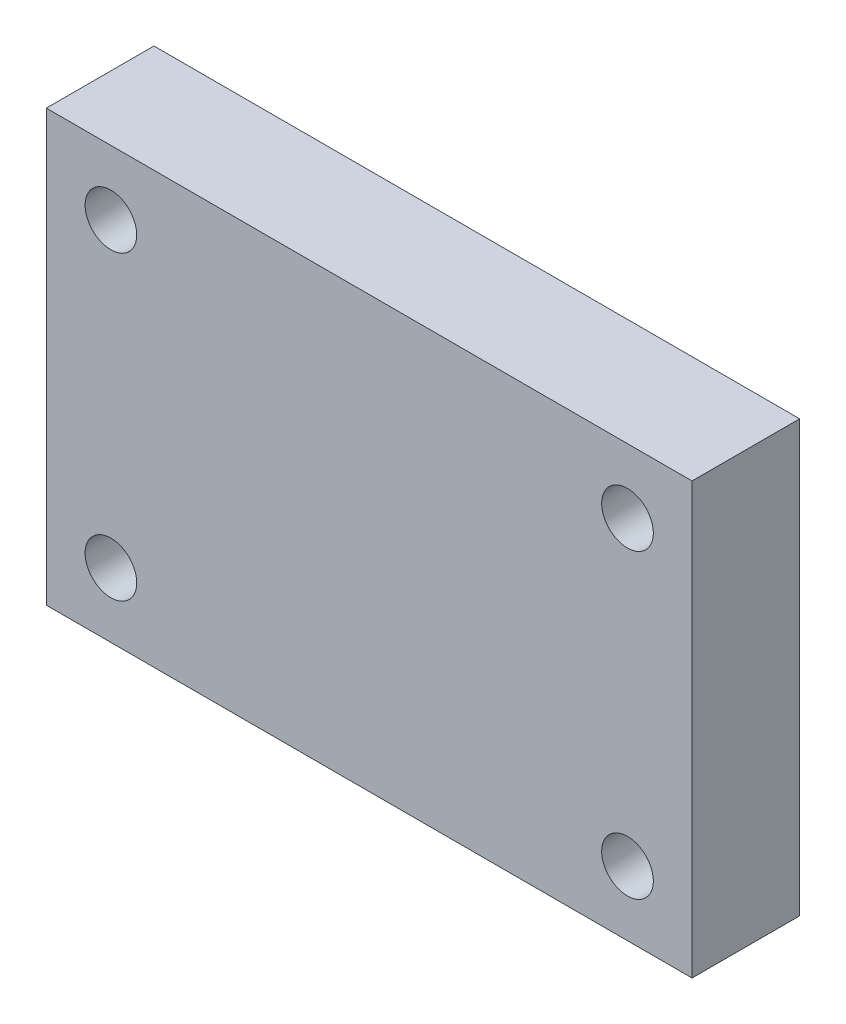
ISO-10303-21;
HEADER;
FILE_DESCRIPTION(('STEP AP214'),'2;1');
FILE_NAME('part.step','',(''),(''),'','','');
FILE_SCHEMA(('AUTOMOTIVE_DESIGN { 1 0 10303 214 1 1 1 1 }'));
ENDSEC;
DATA;
#1=APPLICATION_CONTEXT('core data for automotive mechanical design processes');
#2=APPLICATION_PROTOCOL_DEFINITION('international standard','automotive_design',2000,#1);
#3=PRODUCT_CONTEXT('',#1,'mechanical');
#4=PRODUCT('Part','Part','',(#3));
#5=PRODUCT_RELATED_PRODUCT_CATEGORY('part','',(#4));
#6=PRODUCT_DEFINITION_FORMATION('','',#4);
#7=PRODUCT_DEFINITION_CONTEXT('part definition',#1,'design');
#8=PRODUCT_DEFINITION('design','',#6,#7);
#9=PRODUCT_DEFINITION_SHAPE('','',#8);
#10=(LENGTH_UNIT() NAMED_UNIT(*) SI_UNIT(.MILLI.,.METRE.));
#11=(NAMED_UNIT(*) PLANE_ANGLE_UNIT() SI_UNIT($,.RADIAN.));
#12=(NAMED_UNIT(*) SI_UNIT($,.STERADIAN.) SOLID_ANGLE_UNIT());
#13=UNCERTAINTY_MEASURE_WITH_UNIT(LENGTH_MEASURE(1.E-05),#10,'distance_accuracy_value','');
#14=(GEOMETRIC_REPRESENTATION_CONTEXT(3) GLOBAL_UNCERTAINTY_ASSIGNED_CONTEXT((#13)) GLOBAL_UNIT_ASSIGNED_CONTEXT((#10,
#11,#12)) REPRESENTATION_CONTEXT('',''));
#15=CARTESIAN_POINT('',(0.,0.,0.));
#16=DIRECTION('',(0.,0.,1.));
#17=DIRECTION('',(1.,0.,0.));
#18=AXIS2_PLACEMENT_3D('',#15,#16,#17);
#19=CARTESIAN_POINT('',(0.,0.,6.35));
#20=DIRECTION('',(0.,0.,-1.));
#21=DIRECTION('',(-1.,0.,0.));
#22=AXIS2_PLACEMENT_3D('',#19,#20,#21);
#23=PLANE('',#22);
#24=DIRECTION('',(0.,1.,0.));
#25=VECTOR('',#24,1.);
#26=CARTESIAN_POINT('',(19.05,-12.7,6.35));
#27=LINE('',#26,#25);
#28=CARTESIAN_POINT('',(19.05,-12.7,6.35));
#29=VERTEX_POINT('',#28);
#30=CARTESIAN_POINT('',(19.05,12.7,6.35));
#31=VERTEX_POINT('',#30);
#32=EDGE_CURVE('E84',#29,#31,#27,.T.);
#33=ORIENTED_EDGE('',*,*,#32,.T.);
#34=DIRECTION('',(-1.,0.,0.));
#35=VECTOR('',#34,1.);
#36=CARTESIAN_POINT('',(-19.05,12.7,6.35));
#37=LINE('',#36,#35);
#38=CARTESIAN_POINT('',(-19.05,12.7,6.35));
#39=VERTEX_POINT('',#38);
#40=EDGE_CURVE('E79',#31,#39,#37,.T.);
#41=ORIENTED_EDGE('',*,*,#40,.T.);
#42=DIRECTION('',(0.,-1.,0.));
#43=VECTOR('',#42,1.);
#44=CARTESIAN_POINT('',(-19.05,-12.7,6.35));
#45=LINE('',#44,#43);
#46=CARTESIAN_POINT('',(-19.05,-12.7,6.35));
#47=VERTEX_POINT('',#46);
#48=EDGE_CURVE('E82',#39,#47,#45,.T.);
#49=ORIENTED_EDGE('',*,*,#48,.T.);
#50=DIRECTION('',(1.,0.,0.));
#51=VECTOR('',#50,1.);
#52=CARTESIAN_POINT('',(-19.05,-12.7,6.35));
#53=LINE('',#52,#51);
#54=EDGE_CURVE('E49',#47,#29,#53,.T.);
#55=ORIENTED_EDGE('',*,*,#54,.T.);
#56=EDGE_LOOP('',(#33,#41,#49,#55));
#57=FACE_BOUND('',#56,.T.);
#58=CARTESIAN_POINT('',(-15.24,8.89,6.35));
#59=DIRECTION('',(0.,0.,1.));
#60=DIRECTION('',(1.,0.,0.));
#61=AXIS2_PLACEMENT_3D('',#58,#59,#60);
#62=CIRCLE('',#61,1.524);
#63=CARTESIAN_POINT('',(-13.716,8.89,6.35));
#64=VERTEX_POINT('',#63);
#65=EDGE_CURVE('E99',#64,#64,#62,.T.);
#66=ORIENTED_EDGE('',*,*,#65,.F.);
#67=EDGE_LOOP('',(#66));
#68=FACE_BOUND('',#67,.T.);
#69=CARTESIAN_POINT('',(-15.24,-8.89,6.35));
#70=DIRECTION('',(0.,0.,1.));
#71=DIRECTION('',(1.,0.,0.));
#72=AXIS2_PLACEMENT_3D('',#69,#70,#71);
#73=CIRCLE('',#72,1.524);
#74=CARTESIAN_POINT('',(-13.716,-8.89,6.35));
#75=VERTEX_POINT('',#74);
#76=EDGE_CURVE('E114',#75,#75,#73,.T.);
#77=ORIENTED_EDGE('',*,*,#76,.F.);
#78=EDGE_LOOP('',(#77));
#79=FACE_BOUND('',#78,.T.);
#80=CARTESIAN_POINT('',(15.24,8.89,6.35));
#81=DIRECTION('',(0.,0.,1.));
#82=DIRECTION('',(-1.,0.,0.));
#83=AXIS2_PLACEMENT_3D('',#80,#81,#82);
#84=CIRCLE('',#83,1.524);
#85=CARTESIAN_POINT('',(13.716,8.89,6.35));
#86=VERTEX_POINT('',#85);
#87=EDGE_CURVE('E120',#86,#86,#84,.T.);
#88=ORIENTED_EDGE('',*,*,#87,.F.);
#89=EDGE_LOOP('',(#88));
#90=FACE_BOUND('',#89,.T.);
#91=CARTESIAN_POINT('',(15.24,-8.89,6.35));
#92=DIRECTION('',(0.,0.,1.));
#93=DIRECTION('',(-1.,0.,0.));
#94=AXIS2_PLACEMENT_3D('',#91,#92,#93);
#95=CIRCLE('',#94,1.524);
#96=CARTESIAN_POINT('',(13.716,-8.89,6.35));
#97=VERTEX_POINT('',#96);
#98=EDGE_CURVE('E126',#97,#97,#95,.T.);
#99=ORIENTED_EDGE('',*,*,#98,.F.);
#100=EDGE_LOOP('',(#99));
#101=FACE_BOUND('',#100,.T.);
#102=ADVANCED_FACE('F32',(#57,#68,#79,#90,#101),#23,.F.);
#103=CARTESIAN_POINT('',(0.,0.,0.));
#104=DIRECTION('',(0.,0.,-1.));
#105=DIRECTION('',(-1.,0.,0.));
#106=AXIS2_PLACEMENT_3D('',#103,#104,#105);
#107=PLANE('',#106);
#108=CARTESIAN_POINT('',(15.24,8.89,0.));
#109=DIRECTION('',(0.,0.,1.));
#110=DIRECTION('',(-1.,0.,0.));
#111=AXIS2_PLACEMENT_3D('',#108,#109,#110);
#112=CIRCLE('',#111,1.524);
#113=CARTESIAN_POINT('',(13.716,8.89,0.));
#114=VERTEX_POINT('',#113);
#115=EDGE_CURVE('E123',#114,#114,#112,.T.);
#116=ORIENTED_EDGE('',*,*,#115,.T.);
#117=EDGE_LOOP('',(#116));
#118=FACE_BOUND('',#117,.T.);
#119=CARTESIAN_POINT('',(-15.24,8.89,0.));
#120=DIRECTION('',(0.,0.,1.));
#121=DIRECTION('',(1.,0.,0.));
#122=AXIS2_PLACEMENT_3D('',#119,#120,#121);
#123=CIRCLE('',#122,1.524);
#124=CARTESIAN_POINT('',(-13.716,8.89,0.));
#125=VERTEX_POINT('',#124);
#126=EDGE_CURVE('E111',#125,#125,#123,.T.);
#127=ORIENTED_EDGE('',*,*,#126,.T.);
#128=EDGE_LOOP('',(#127));
#129=FACE_BOUND('',#128,.T.);
#130=DIRECTION('',(0.,1.,0.));
#131=VECTOR('',#130,1.);
#132=CARTESIAN_POINT('',(19.05,-12.7,0.));
#133=LINE('',#132,#131);
#134=CARTESIAN_POINT('',(19.05,-12.7,0.));
#135=VERTEX_POINT('',#134);
#136=CARTESIAN_POINT('',(19.05,12.7,0.));
#137=VERTEX_POINT('',#136);
#138=EDGE_CURVE('E96',#135,#137,#133,.T.);
#139=ORIENTED_EDGE('',*,*,#138,.F.);
#140=DIRECTION('',(1.,0.,0.));
#141=VECTOR('',#140,1.);
#142=CARTESIAN_POINT('',(-19.05,-12.7,0.));
#143=LINE('',#142,#141);
#144=CARTESIAN_POINT('',(-19.05,-12.7,0.));
#145=VERTEX_POINT('',#144);
#146=EDGE_CURVE('E72',#145,#135,#143,.T.);
#147=ORIENTED_EDGE('',*,*,#146,.F.);
#148=DIRECTION('',(0.,-1.,0.));
#149=VECTOR('',#148,1.);
#150=CARTESIAN_POINT('',(-19.05,-12.7,0.));
#151=LINE('',#150,#149);
#152=CARTESIAN_POINT('',(-19.05,12.7,0.));
#153=VERTEX_POINT('',#152);
#154=EDGE_CURVE('E66',#153,#145,#151,.T.);
#155=ORIENTED_EDGE('',*,*,#154,.F.);
#156=DIRECTION('',(-1.,0.,0.));
#157=VECTOR('',#156,1.);
#158=CARTESIAN_POINT('',(-19.05,12.7,0.));
#159=LINE('',#158,#157);
#160=EDGE_CURVE('E88',#137,#153,#159,.T.);
#161=ORIENTED_EDGE('',*,*,#160,.F.);
#162=EDGE_LOOP('',(#139,#147,#155,#161));
#163=FACE_BOUND('',#162,.T.);
#164=CARTESIAN_POINT('',(-15.24,-8.89,0.));
#165=DIRECTION('',(0.,0.,1.));
#166=DIRECTION('',(1.,0.,0.));
#167=AXIS2_PLACEMENT_3D('',#164,#165,#166);
#168=CIRCLE('',#167,1.524);
#169=CARTESIAN_POINT('',(-13.716,-8.89,0.));
#170=VERTEX_POINT('',#169);
#171=EDGE_CURVE('E117',#170,#170,#168,.T.);
#172=ORIENTED_EDGE('',*,*,#171,.T.);
#173=EDGE_LOOP('',(#172));
#174=FACE_BOUND('',#173,.T.);
#175=CARTESIAN_POINT('',(15.24,-8.89,0.));
#176=DIRECTION('',(0.,0.,1.));
#177=DIRECTION('',(-1.,0.,0.));
#178=AXIS2_PLACEMENT_3D('',#175,#176,#177);
#179=CIRCLE('',#178,1.524);
#180=CARTESIAN_POINT('',(13.716,-8.89,0.));
#181=VERTEX_POINT('',#180);
#182=EDGE_CURVE('E129',#181,#181,#179,.T.);
#183=ORIENTED_EDGE('',*,*,#182,.T.);
#184=EDGE_LOOP('',(#183));
#185=FACE_BOUND('',#184,.T.);
#186=ADVANCED_FACE('F107',(#118,#129,#163,#174,#185),#107,.T.);
#187=CARTESIAN_POINT('',(19.05,-12.7,6.35));
#188=DIRECTION('',(-1.,0.,0.));
#189=DIRECTION('',(0.,0.,1.));
#190=AXIS2_PLACEMENT_3D('',#187,#188,#189);
#191=PLANE('',#190);
#192=ORIENTED_EDGE('',*,*,#138,.T.);
#193=DIRECTION('',(0.,0.,-1.));
#194=VECTOR('',#193,1.);
#195=CARTESIAN_POINT('',(19.05,12.7,6.35));
#196=LINE('',#195,#194);
#197=EDGE_CURVE('E11',#31,#137,#196,.T.);
#198=ORIENTED_EDGE('',*,*,#197,.F.);
#199=ORIENTED_EDGE('',*,*,#32,.F.);
#200=DIRECTION('',(0.,0.,-1.));
#201=VECTOR('',#200,1.);
#202=CARTESIAN_POINT('',(19.05,-12.7,6.35));
#203=LINE('',#202,#201);
#204=EDGE_CURVE('E92',#29,#135,#203,.T.);
#205=ORIENTED_EDGE('',*,*,#204,.T.);
#206=EDGE_LOOP('',(#192,#198,#199,#205));
#207=FACE_BOUND('',#206,.T.);
#208=ADVANCED_FACE('F34',(#207),#191,.F.);
#209=CARTESIAN_POINT('',(-19.05,12.7,6.35));
#210=DIRECTION('',(0.,-1.,0.));
#211=DIRECTION('',(0.,0.,-1.));
#212=AXIS2_PLACEMENT_3D('',#209,#210,#211);
#213=PLANE('',#212);
#214=ORIENTED_EDGE('',*,*,#160,.T.);
#215=DIRECTION('',(0.,0.,-1.));
#216=VECTOR('',#215,1.);
#217=CARTESIAN_POINT('',(-19.05,12.7,6.35));
#218=LINE('',#217,#216);
#219=EDGE_CURVE('E41',#39,#153,#218,.T.);
#220=ORIENTED_EDGE('',*,*,#219,.F.);
#221=ORIENTED_EDGE('',*,*,#40,.F.);
#222=ORIENTED_EDGE('',*,*,#197,.T.);
#223=EDGE_LOOP('',(#214,#220,#221,#222));
#224=FACE_BOUND('',#223,.T.);
#225=ADVANCED_FACE('F87',(#224),#213,.F.);
#226=CARTESIAN_POINT('',(-19.05,-12.7,6.35));
#227=DIRECTION('',(1.,0.,0.));
#228=DIRECTION('',(0.,0.,-1.));
#229=AXIS2_PLACEMENT_3D('',#226,#227,#228);
#230=PLANE('',#229);
#231=ORIENTED_EDGE('',*,*,#154,.T.);
#232=DIRECTION('',(0.,0.,-1.));
#233=VECTOR('',#232,1.);
#234=CARTESIAN_POINT('',(-19.05,-12.7,6.35));
#235=LINE('',#234,#233);
#236=EDGE_CURVE('E89',#47,#145,#235,.T.);
#237=ORIENTED_EDGE('',*,*,#236,.F.);
#238=ORIENTED_EDGE('',*,*,#48,.F.);
#239=ORIENTED_EDGE('',*,*,#219,.T.);
#240=EDGE_LOOP('',(#231,#237,#238,#239));
#241=FACE_BOUND('',#240,.T.);
#242=ADVANCED_FACE('F90',(#241),#230,.F.);
#243=CARTESIAN_POINT('',(-19.05,-12.7,6.35));
#244=DIRECTION('',(0.,1.,0.));
#245=DIRECTION('',(0.,0.,1.));
#246=AXIS2_PLACEMENT_3D('',#243,#244,#245);
#247=PLANE('',#246);
#248=ORIENTED_EDGE('',*,*,#146,.T.);
#249=ORIENTED_EDGE('',*,*,#204,.F.);
#250=ORIENTED_EDGE('',*,*,#54,.F.);
#251=ORIENTED_EDGE('',*,*,#236,.T.);
#252=EDGE_LOOP('',(#248,#249,#250,#251));
#253=FACE_BOUND('',#252,.T.);
#254=ADVANCED_FACE('F104',(#253),#247,.F.);
#255=CARTESIAN_POINT('',(-15.24,8.89,6.35));
#256=DIRECTION('',(0.,0.,-1.));
#257=DIRECTION('',(-1.,0.,0.));
#258=AXIS2_PLACEMENT_3D('',#255,#256,#257);
#259=CYLINDRICAL_SURFACE('',#258,1.524);
#260=ORIENTED_EDGE('',*,*,#65,.T.);
#261=EDGE_LOOP('',(#260));
#262=FACE_BOUND('',#261,.T.);
#263=ORIENTED_EDGE('',*,*,#126,.F.);
#264=EDGE_LOOP('',(#263));
#265=FACE_BOUND('',#264,.T.);
#266=ADVANCED_FACE('F146',(#262,#265),#259,.F.);
#267=CARTESIAN_POINT('',(-15.24,-8.89,6.35));
#268=DIRECTION('',(0.,0.,-1.));
#269=DIRECTION('',(-1.,0.,0.));
#270=AXIS2_PLACEMENT_3D('',#267,#268,#269);
#271=CYLINDRICAL_SURFACE('',#270,1.524);
#272=ORIENTED_EDGE('',*,*,#76,.T.);
#273=EDGE_LOOP('',(#272));
#274=FACE_BOUND('',#273,.T.);
#275=ORIENTED_EDGE('',*,*,#171,.F.);
#276=EDGE_LOOP('',(#275));
#277=FACE_BOUND('',#276,.T.);
#278=ADVANCED_FACE('F192',(#274,#277),#271,.F.);
#279=CARTESIAN_POINT('',(15.24,8.89,6.35));
#280=DIRECTION('',(0.,0.,-1.));
#281=DIRECTION('',(-1.,0.,0.));
#282=AXIS2_PLACEMENT_3D('',#279,#280,#281);
#283=CYLINDRICAL_SURFACE('',#282,1.524);
#284=ORIENTED_EDGE('',*,*,#87,.T.);
#285=EDGE_LOOP('',(#284));
#286=FACE_BOUND('',#285,.T.);
#287=ORIENTED_EDGE('',*,*,#115,.F.);
#288=EDGE_LOOP('',(#287));
#289=FACE_BOUND('',#288,.T.);
#290=ADVANCED_FACE('F200',(#286,#289),#283,.F.);
#291=CARTESIAN_POINT('',(15.24,-8.89,6.35));
#292=DIRECTION('',(0.,0.,-1.));
#293=DIRECTION('',(-1.,0.,0.));
#294=AXIS2_PLACEMENT_3D('',#291,#292,#293);
#295=CYLINDRICAL_SURFACE('',#294,1.524);
#296=ORIENTED_EDGE('',*,*,#98,.T.);
#297=EDGE_LOOP('',(#296));
#298=FACE_BOUND('',#297,.T.);
#299=ORIENTED_EDGE('',*,*,#182,.F.);
#300=EDGE_LOOP('',(#299));
#301=FACE_BOUND('',#300,.T.);
#302=ADVANCED_FACE('F135',(#298,#301),#295,.F.);
#303=CLOSED_SHELL('',(#102,#186,#208,#225,#242,#254,#266,#278,#290,#302));
#304=MANIFOLD_SOLID_BREP('B2',#303);
#305=ADVANCED_BREP_SHAPE_REPRESENTATION('',(#18,#304),#14);
#306=SHAPE_DEFINITION_REPRESENTATION(#9,#305);
ENDSEC;
END-ISO-10303-21;
